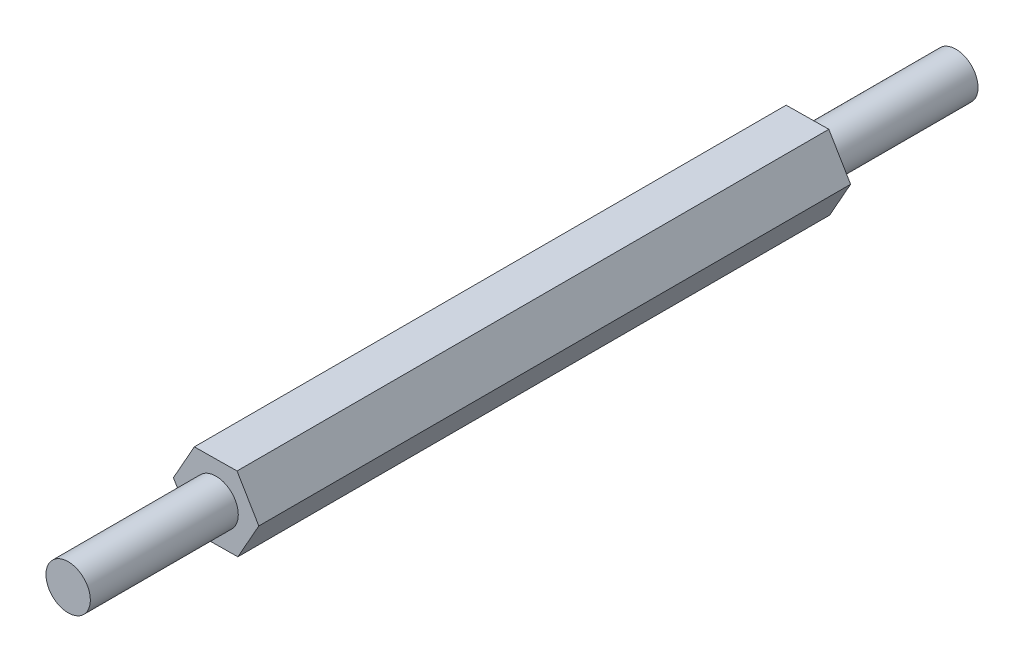
ISO-10303-21;
HEADER;
FILE_DESCRIPTION(('STEP AP214'),'2;1');
FILE_NAME('part.step','',(''),(''),'','','');
FILE_SCHEMA(('AUTOMOTIVE_DESIGN { 1 0 10303 214 1 1 1 1 }'));
ENDSEC;
DATA;
#1=APPLICATION_CONTEXT('core data for automotive mechanical design processes');
#2=APPLICATION_PROTOCOL_DEFINITION('international standard','automotive_design',2000,#1);
#3=PRODUCT_CONTEXT('',#1,'mechanical');
#4=PRODUCT('Part','Part','',(#3));
#5=PRODUCT_RELATED_PRODUCT_CATEGORY('part','',(#4));
#6=PRODUCT_DEFINITION_FORMATION('','',#4);
#7=PRODUCT_DEFINITION_CONTEXT('part definition',#1,'design');
#8=PRODUCT_DEFINITION('design','',#6,#7);
#9=PRODUCT_DEFINITION_SHAPE('','',#8);
#10=(LENGTH_UNIT() NAMED_UNIT(*) SI_UNIT(.MILLI.,.METRE.));
#11=(NAMED_UNIT(*) PLANE_ANGLE_UNIT() SI_UNIT($,.RADIAN.));
#12=(NAMED_UNIT(*) SI_UNIT($,.STERADIAN.) SOLID_ANGLE_UNIT());
#13=UNCERTAINTY_MEASURE_WITH_UNIT(LENGTH_MEASURE(1.E-05),#10,'distance_accuracy_value','');
#14=(GEOMETRIC_REPRESENTATION_CONTEXT(3) GLOBAL_UNCERTAINTY_ASSIGNED_CONTEXT((#13)) GLOBAL_UNIT_ASSIGNED_CONTEXT((#10,
#11,#12)) REPRESENTATION_CONTEXT('',''));
#15=CARTESIAN_POINT('',(0.,0.,0.));
#16=DIRECTION('',(0.,0.,1.));
#17=DIRECTION('',(1.,0.,0.));
#18=AXIS2_PLACEMENT_3D('',#15,#16,#17);
#19=CARTESIAN_POINT('',(-1.41612983543345,-2.51553366555261,40.));
#20=DIRECTION('',(-0.010864261058674,0.999940982174273,0.));
#21=DIRECTION('',(-0.999940982174273,-0.010864261058674,0.));
#22=AXIS2_PLACEMENT_3D('',#19,#20,#21);
#23=PLANE('',#22);
#24=DIRECTION('',(0.999940982174273,0.010864261058674,0.));
#25=VECTOR('',#24,1.);
#26=CARTESIAN_POINT('',(-1.41612983543345,-2.51553366555261,0.));
#27=LINE('',#26,#25);
#28=CARTESIAN_POINT('',(-1.41612983543345,-2.51553366555261,0.));
#29=VERTEX_POINT('',#28);
#30=CARTESIAN_POINT('',(1.47045114072682,-2.48417124531875,0.));
#31=VERTEX_POINT('',#30);
#32=EDGE_CURVE('E124',#29,#31,#27,.T.);
#33=ORIENTED_EDGE('',*,*,#32,.T.);
#34=DIRECTION('',(0.,0.,-1.));
#35=VECTOR('',#34,1.);
#36=CARTESIAN_POINT('',(1.47045114072682,-2.48417124531875,40.));
#37=LINE('',#36,#35);
#38=CARTESIAN_POINT('',(1.47045114072682,-2.48417124531875,40.));
#39=VERTEX_POINT('',#38);
#40=EDGE_CURVE('E40',#39,#31,#37,.T.);
#41=ORIENTED_EDGE('',*,*,#40,.F.);
#42=DIRECTION('',(0.999940982174273,0.010864261058674,0.));
#43=VECTOR('',#42,1.);
#44=CARTESIAN_POINT('',(-1.41612983543345,-2.51553366555261,40.));
#45=LINE('',#44,#43);
#46=CARTESIAN_POINT('',(-1.41612983543345,-2.51553366555261,40.));
#47=VERTEX_POINT('',#46);
#48=EDGE_CURVE('E135',#47,#39,#45,.T.);
#49=ORIENTED_EDGE('',*,*,#48,.F.);
#50=DIRECTION('',(0.,0.,-1.));
#51=VECTOR('',#50,1.);
#52=CARTESIAN_POINT('',(-1.41612983543345,-2.51553366555261,40.));
#53=LINE('',#52,#51);
#54=EDGE_CURVE('E120',#47,#29,#53,.T.);
#55=ORIENTED_EDGE('',*,*,#54,.T.);
#56=EDGE_LOOP('',(#33,#41,#49,#55));
#57=FACE_BOUND('',#56,.T.);
#58=ADVANCED_FACE('F37',(#57),#23,.F.);
#59=CARTESIAN_POINT('',(1.47045114072682,-2.48417124531875,40.));
#60=DIRECTION('',(-0.871406423377419,0.49056176501698,0.));
#61=DIRECTION('',(-0.49056176501698,-0.871406423377419,0.));
#62=AXIS2_PLACEMENT_3D('',#59,#60,#61);
#63=PLANE('',#62);
#64=DIRECTION('',(0.49056176501698,0.871406423377419,0.));
#65=VECTOR('',#64,1.);
#66=CARTESIAN_POINT('',(1.47045114072682,-2.48417124531875,0.));
#67=LINE('',#66,#65);
#68=CARTESIAN_POINT('',(2.88658097616028,0.0313624202338582,0.));
#69=VERTEX_POINT('',#68);
#70=EDGE_CURVE('E127',#31,#69,#67,.T.);
#71=ORIENTED_EDGE('',*,*,#70,.T.);
#72=DIRECTION('',(0.,0.,-1.));
#73=VECTOR('',#72,1.);
#74=CARTESIAN_POINT('',(2.88658097616028,0.0313624202338582,40.));
#75=LINE('',#74,#73);
#76=CARTESIAN_POINT('',(2.88658097616028,0.0313624202338582,40.));
#77=VERTEX_POINT('',#76);
#78=EDGE_CURVE('E138',#77,#69,#75,.T.);
#79=ORIENTED_EDGE('',*,*,#78,.F.);
#80=DIRECTION('',(0.49056176501698,0.871406423377419,0.));
#81=VECTOR('',#80,1.);
#82=CARTESIAN_POINT('',(1.47045114072682,-2.48417124531875,40.));
#83=LINE('',#82,#81);
#84=EDGE_CURVE('E93',#39,#77,#83,.T.);
#85=ORIENTED_EDGE('',*,*,#84,.F.);
#86=ORIENTED_EDGE('',*,*,#40,.T.);
#87=EDGE_LOOP('',(#71,#79,#85,#86));
#88=FACE_BOUND('',#87,.T.);
#89=ADVANCED_FACE('F151',(#88),#63,.F.);
#90=CARTESIAN_POINT('',(2.88658097616028,0.0313624202338582,40.));
#91=DIRECTION('',(-0.860542162318746,-0.509379217157293,0.));
#92=DIRECTION('',(0.509379217157293,-0.860542162318746,0.));
#93=AXIS2_PLACEMENT_3D('',#90,#91,#92);
#94=PLANE('',#93);
#95=DIRECTION('',(-0.509379217157293,0.860542162318746,0.));
#96=VECTOR('',#95,1.);
#97=CARTESIAN_POINT('',(2.88658097616028,0.0313624202338582,0.));
#98=LINE('',#97,#96);
#99=CARTESIAN_POINT('',(1.41612983543346,2.51553366555261,0.));
#100=VERTEX_POINT('',#99);
#101=EDGE_CURVE('E130',#69,#100,#98,.T.);
#102=ORIENTED_EDGE('',*,*,#101,.T.);
#103=DIRECTION('',(0.,0.,-1.));
#104=VECTOR('',#103,1.);
#105=CARTESIAN_POINT('',(1.41612983543346,2.51553366555261,40.));
#106=LINE('',#105,#104);
#107=CARTESIAN_POINT('',(1.41612983543346,2.51553366555261,40.));
#108=VERTEX_POINT('',#107);
#109=EDGE_CURVE('E115',#108,#100,#106,.T.);
#110=ORIENTED_EDGE('',*,*,#109,.F.);
#111=DIRECTION('',(-0.509379217157293,0.860542162318746,0.));
#112=VECTOR('',#111,1.);
#113=CARTESIAN_POINT('',(2.88658097616028,0.0313624202338582,40.));
#114=LINE('',#113,#112);
#115=EDGE_CURVE('E106',#77,#108,#114,.T.);
#116=ORIENTED_EDGE('',*,*,#115,.F.);
#117=ORIENTED_EDGE('',*,*,#78,.T.);
#118=EDGE_LOOP('',(#102,#110,#116,#117));
#119=FACE_BOUND('',#118,.T.);
#120=ADVANCED_FACE('F152',(#119),#94,.F.);
#121=CARTESIAN_POINT('',(1.41612983543346,2.51553366555261,40.));
#122=DIRECTION('',(0.0108642610586746,-0.999940982174273,0.));
#123=DIRECTION('',(0.999940982174273,0.0108642610586746,0.));
#124=AXIS2_PLACEMENT_3D('',#121,#122,#123);
#125=PLANE('',#124);
#126=DIRECTION('',(-0.999940982174273,-0.0108642610586746,0.));
#127=VECTOR('',#126,1.);
#128=CARTESIAN_POINT('',(1.41612983543346,2.51553366555261,0.));
#129=LINE('',#128,#127);
#130=CARTESIAN_POINT('',(-1.47045114072682,2.48417124531875,0.));
#131=VERTEX_POINT('',#130);
#132=EDGE_CURVE('E114',#100,#131,#129,.T.);
#133=ORIENTED_EDGE('',*,*,#132,.T.);
#134=DIRECTION('',(0.,0.,-1.));
#135=VECTOR('',#134,1.);
#136=CARTESIAN_POINT('',(-1.47045114072682,2.48417124531875,40.));
#137=LINE('',#136,#135);
#138=CARTESIAN_POINT('',(-1.47045114072682,2.48417124531875,40.));
#139=VERTEX_POINT('',#138);
#140=EDGE_CURVE('E111',#139,#131,#137,.T.);
#141=ORIENTED_EDGE('',*,*,#140,.F.);
#142=DIRECTION('',(-0.999940982174273,-0.0108642610586746,0.));
#143=VECTOR('',#142,1.);
#144=CARTESIAN_POINT('',(1.41612983543346,2.51553366555261,40.));
#145=LINE('',#144,#143);
#146=EDGE_CURVE('E100',#108,#139,#145,.T.);
#147=ORIENTED_EDGE('',*,*,#146,.F.);
#148=ORIENTED_EDGE('',*,*,#109,.T.);
#149=EDGE_LOOP('',(#133,#141,#147,#148));
#150=FACE_BOUND('',#149,.T.);
#151=ADVANCED_FACE('F112',(#150),#125,.F.);
#152=CARTESIAN_POINT('',(-1.47045114072682,2.48417124531875,40.));
#153=DIRECTION('',(0.87140642337742,-0.490561765016978,0.));
#154=DIRECTION('',(0.490561765016978,0.87140642337742,0.));
#155=AXIS2_PLACEMENT_3D('',#152,#153,#154);
#156=PLANE('',#155);
#157=DIRECTION('',(-0.490561765016978,-0.87140642337742,0.));
#158=VECTOR('',#157,1.);
#159=CARTESIAN_POINT('',(-1.47045114072682,2.48417124531875,0.));
#160=LINE('',#159,#158);
#161=CARTESIAN_POINT('',(-2.88658097616028,-0.0313624202338615,0.));
#162=VERTEX_POINT('',#161);
#163=EDGE_CURVE('E78',#131,#162,#160,.T.);
#164=ORIENTED_EDGE('',*,*,#163,.T.);
#165=DIRECTION('',(0.,0.,-1.));
#166=VECTOR('',#165,1.);
#167=CARTESIAN_POINT('',(-2.88658097616028,-0.0313624202338615,40.));
#168=LINE('',#167,#166);
#169=CARTESIAN_POINT('',(-2.88658097616028,-0.0313624202338615,40.));
#170=VERTEX_POINT('',#169);
#171=EDGE_CURVE('E116',#170,#162,#168,.T.);
#172=ORIENTED_EDGE('',*,*,#171,.F.);
#173=DIRECTION('',(-0.490561765016978,-0.87140642337742,0.));
#174=VECTOR('',#173,1.);
#175=CARTESIAN_POINT('',(-1.47045114072682,2.48417124531875,40.));
#176=LINE('',#175,#174);
#177=EDGE_CURVE('E104',#139,#170,#176,.T.);
#178=ORIENTED_EDGE('',*,*,#177,.F.);
#179=ORIENTED_EDGE('',*,*,#140,.T.);
#180=EDGE_LOOP('',(#164,#172,#178,#179));
#181=FACE_BOUND('',#180,.T.);
#182=ADVANCED_FACE('F118',(#181),#156,.F.);
#183=CARTESIAN_POINT('',(-2.88658097616028,-0.0313624202338615,40.));
#184=DIRECTION('',(0.860542162318745,0.509379217157295,0.));
#185=DIRECTION('',(-0.509379217157295,0.860542162318745,0.));
#186=AXIS2_PLACEMENT_3D('',#183,#184,#185);
#187=PLANE('',#186);
#188=DIRECTION('',(0.509379217157295,-0.860542162318745,0.));
#189=VECTOR('',#188,1.);
#190=CARTESIAN_POINT('',(-2.88658097616028,-0.0313624202338615,0.));
#191=LINE('',#190,#189);
#192=EDGE_CURVE('E84',#162,#29,#191,.T.);
#193=ORIENTED_EDGE('',*,*,#192,.T.);
#194=ORIENTED_EDGE('',*,*,#54,.F.);
#195=DIRECTION('',(0.509379217157295,-0.860542162318745,0.));
#196=VECTOR('',#195,1.);
#197=CARTESIAN_POINT('',(-2.88658097616028,-0.0313624202338615,40.));
#198=LINE('',#197,#196);
#199=EDGE_CURVE('E55',#170,#47,#198,.T.);
#200=ORIENTED_EDGE('',*,*,#199,.F.);
#201=ORIENTED_EDGE('',*,*,#171,.T.);
#202=EDGE_LOOP('',(#193,#194,#200,#201));
#203=FACE_BOUND('',#202,.T.);
#204=ADVANCED_FACE('F157',(#203),#187,.F.);
#205=CARTESIAN_POINT('',(0.,0.,40.));
#206=DIRECTION('',(0.,0.,1.));
#207=DIRECTION('',(1.,0.,0.));
#208=AXIS2_PLACEMENT_3D('',#205,#206,#207);
#209=PLANE('',#208);
#210=CARTESIAN_POINT('',(0.,0.,40.));
#211=DIRECTION('',(0.,0.,1.));
#212=DIRECTION('',(1.,0.,0.));
#213=AXIS2_PLACEMENT_3D('',#210,#211,#212);
#214=CIRCLE('',#213,1.5);
#215=CARTESIAN_POINT('',(1.5,0.,40.));
#216=VERTEX_POINT('',#215);
#217=EDGE_CURVE('E46',#216,#216,#214,.T.);
#218=ORIENTED_EDGE('',*,*,#217,.F.);
#219=EDGE_LOOP('',(#218));
#220=FACE_BOUND('',#219,.T.);
#221=ORIENTED_EDGE('',*,*,#48,.T.);
#222=ORIENTED_EDGE('',*,*,#84,.T.);
#223=ORIENTED_EDGE('',*,*,#115,.T.);
#224=ORIENTED_EDGE('',*,*,#146,.T.);
#225=ORIENTED_EDGE('',*,*,#177,.T.);
#226=ORIENTED_EDGE('',*,*,#199,.T.);
#227=EDGE_LOOP('',(#221,#222,#223,#224,#225,#226));
#228=FACE_BOUND('',#227,.T.);
#229=ADVANCED_FACE('F102',(#220,#228),#209,.T.);
#230=CARTESIAN_POINT('',(0.,0.,0.));
#231=DIRECTION('',(0.,0.,1.));
#232=DIRECTION('',(1.,0.,0.));
#233=AXIS2_PLACEMENT_3D('',#230,#231,#232);
#234=PLANE('',#233);
#235=CARTESIAN_POINT('',(0.,0.,0.));
#236=DIRECTION('',(0.,0.,-1.));
#237=DIRECTION('',(-1.,0.,0.));
#238=AXIS2_PLACEMENT_3D('',#235,#236,#237);
#239=CIRCLE('',#238,1.5);
#240=CARTESIAN_POINT('',(-1.5,0.,0.));
#241=VERTEX_POINT('',#240);
#242=EDGE_CURVE('E11',#241,#241,#239,.T.);
#243=ORIENTED_EDGE('',*,*,#242,.F.);
#244=EDGE_LOOP('',(#243));
#245=FACE_BOUND('',#244,.T.);
#246=ORIENTED_EDGE('',*,*,#32,.F.);
#247=ORIENTED_EDGE('',*,*,#192,.F.);
#248=ORIENTED_EDGE('',*,*,#163,.F.);
#249=ORIENTED_EDGE('',*,*,#132,.F.);
#250=ORIENTED_EDGE('',*,*,#101,.F.);
#251=ORIENTED_EDGE('',*,*,#70,.F.);
#252=EDGE_LOOP('',(#246,#247,#248,#249,#250,#251));
#253=FACE_BOUND('',#252,.T.);
#254=ADVANCED_FACE('F155',(#245,#253),#234,.F.);
#255=CARTESIAN_POINT('',(0.,0.,50.));
#256=DIRECTION('',(0.,0.,-1.));
#257=DIRECTION('',(-1.,0.,0.));
#258=AXIS2_PLACEMENT_3D('',#255,#256,#257);
#259=CYLINDRICAL_SURFACE('',#258,1.5);
#260=CARTESIAN_POINT('',(0.,0.,50.));
#261=DIRECTION('',(0.,0.,1.));
#262=DIRECTION('',(1.,0.,0.));
#263=AXIS2_PLACEMENT_3D('',#260,#261,#262);
#264=CIRCLE('',#263,1.5);
#265=CARTESIAN_POINT('',(1.5,0.,50.));
#266=VERTEX_POINT('',#265);
#267=EDGE_CURVE('E128',#266,#266,#264,.T.);
#268=ORIENTED_EDGE('',*,*,#267,.F.);
#269=EDGE_LOOP('',(#268));
#270=FACE_BOUND('',#269,.T.);
#271=ORIENTED_EDGE('',*,*,#217,.T.);
#272=EDGE_LOOP('',(#271));
#273=FACE_BOUND('',#272,.T.);
#274=ADVANCED_FACE('F206',(#270,#273),#259,.T.);
#275=CARTESIAN_POINT('',(0.,0.,50.));
#276=DIRECTION('',(0.,0.,1.));
#277=DIRECTION('',(1.,0.,0.));
#278=AXIS2_PLACEMENT_3D('',#275,#276,#277);
#279=PLANE('',#278);
#280=ORIENTED_EDGE('',*,*,#267,.T.);
#281=EDGE_LOOP('',(#280));
#282=FACE_BOUND('',#281,.T.);
#283=ADVANCED_FACE('F211',(#282),#279,.T.);
#284=CARTESIAN_POINT('',(0.,0.,-10.));
#285=DIRECTION('',(0.,0.,1.));
#286=DIRECTION('',(1.,0.,0.));
#287=AXIS2_PLACEMENT_3D('',#284,#285,#286);
#288=CYLINDRICAL_SURFACE('',#287,1.5);
#289=CARTESIAN_POINT('',(0.,0.,-10.));
#290=DIRECTION('',(0.,0.,-1.));
#291=DIRECTION('',(-1.,0.,0.));
#292=AXIS2_PLACEMENT_3D('',#289,#290,#291);
#293=CIRCLE('',#292,1.5);
#294=CARTESIAN_POINT('',(-1.5,0.,-10.));
#295=VERTEX_POINT('',#294);
#296=EDGE_CURVE('E288',#295,#295,#293,.T.);
#297=ORIENTED_EDGE('',*,*,#296,.F.);
#298=EDGE_LOOP('',(#297));
#299=FACE_BOUND('',#298,.T.);
#300=ORIENTED_EDGE('',*,*,#242,.T.);
#301=EDGE_LOOP('',(#300));
#302=FACE_BOUND('',#301,.T.);
#303=ADVANCED_FACE('F222',(#299,#302),#288,.T.);
#304=CARTESIAN_POINT('',(0.,0.,-10.));
#305=DIRECTION('',(0.,0.,-1.));
#306=DIRECTION('',(-1.,0.,0.));
#307=AXIS2_PLACEMENT_3D('',#304,#305,#306);
#308=PLANE('',#307);
#309=ORIENTED_EDGE('',*,*,#296,.T.);
#310=EDGE_LOOP('',(#309));
#311=FACE_BOUND('',#310,.T.);
#312=ADVANCED_FACE('F240',(#311),#308,.T.);
#313=CLOSED_SHELL('',(#58,#89,#120,#151,#182,#204,#229,#254,#274,#283,#303,#312));
#314=MANIFOLD_SOLID_BREP('B2',#313);
#315=ADVANCED_BREP_SHAPE_REPRESENTATION('',(#18,#314),#14);
#316=SHAPE_DEFINITION_REPRESENTATION(#9,#315);
ENDSEC;
END-ISO-10303-21;
